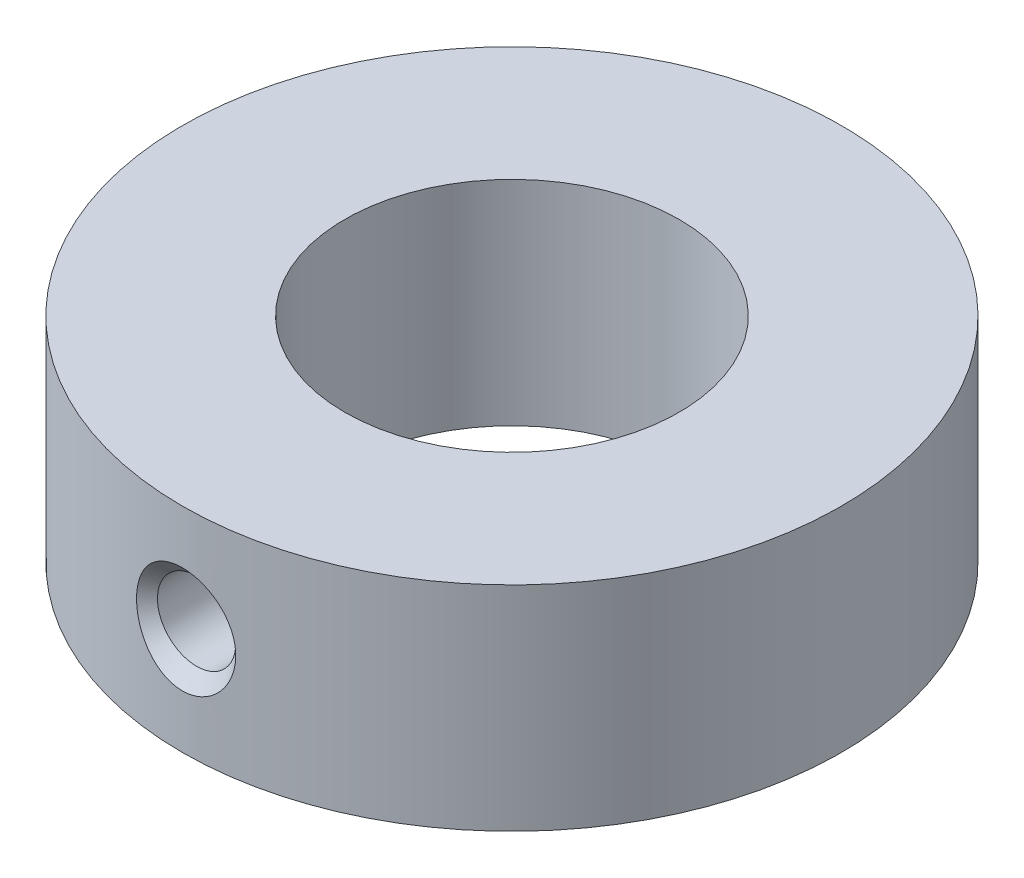
ISO-10303-21;
HEADER;
FILE_DESCRIPTION(('STEP AP214'),'2;1');
FILE_NAME('part.step','',(''),(''),'','','');
FILE_SCHEMA(('AUTOMOTIVE_DESIGN { 1 0 10303 214 1 1 1 1 }'));
ENDSEC;
DATA;
#1=APPLICATION_CONTEXT('core data for automotive mechanical design processes');
#2=APPLICATION_PROTOCOL_DEFINITION('international standard','automotive_design',2000,#1);
#3=PRODUCT_CONTEXT('',#1,'mechanical');
#4=PRODUCT('Part','Part','',(#3));
#5=PRODUCT_RELATED_PRODUCT_CATEGORY('part','',(#4));
#6=PRODUCT_DEFINITION_FORMATION('','',#4);
#7=PRODUCT_DEFINITION_CONTEXT('part definition',#1,'design');
#8=PRODUCT_DEFINITION('design','',#6,#7);
#9=PRODUCT_DEFINITION_SHAPE('','',#8);
#10=(LENGTH_UNIT() NAMED_UNIT(*) SI_UNIT(.MILLI.,.METRE.));
#11=(NAMED_UNIT(*) PLANE_ANGLE_UNIT() SI_UNIT($,.RADIAN.));
#12=(NAMED_UNIT(*) SI_UNIT($,.STERADIAN.) SOLID_ANGLE_UNIT());
#13=UNCERTAINTY_MEASURE_WITH_UNIT(LENGTH_MEASURE(1.E-05),#10,'distance_accuracy_value','');
#14=(GEOMETRIC_REPRESENTATION_CONTEXT(3) GLOBAL_UNCERTAINTY_ASSIGNED_CONTEXT((#13)) GLOBAL_UNIT_ASSIGNED_CONTEXT((#10,
#11,#12)) REPRESENTATION_CONTEXT('',''));
#15=CARTESIAN_POINT('',(0.,0.,0.));
#16=DIRECTION('',(0.,0.,1.));
#17=DIRECTION('',(1.,0.,0.));
#18=AXIS2_PLACEMENT_3D('',#15,#16,#17);
#19=CARTESIAN_POINT('',(0.,9.,0.));
#20=DIRECTION('',(0.,1.,0.));
#21=DIRECTION('',(0.,0.,1.));
#22=AXIS2_PLACEMENT_3D('',#19,#20,#21);
#23=PLANE('',#22);
#24=CARTESIAN_POINT('',(0.,9.,0.));
#25=DIRECTION('',(0.,1.,0.));
#26=DIRECTION('',(0.,0.,1.));
#27=AXIS2_PLACEMENT_3D('',#24,#25,#26);
#28=CIRCLE('',#27,13.9);
#29=CARTESIAN_POINT('',(0.,9.,13.9));
#30=VERTEX_POINT('',#29);
#31=EDGE_CURVE('E43',#30,#30,#28,.T.);
#32=ORIENTED_EDGE('',*,*,#31,.T.);
#33=EDGE_LOOP('',(#32));
#34=FACE_BOUND('',#33,.T.);
#35=CARTESIAN_POINT('',(0.,9.,0.));
#36=DIRECTION('',(0.,1.,0.));
#37=DIRECTION('',(0.,0.,1.));
#38=AXIS2_PLACEMENT_3D('',#35,#36,#37);
#39=CIRCLE('',#38,7.05);
#40=CARTESIAN_POINT('',(0.,9.,7.05));
#41=VERTEX_POINT('',#40);
#42=EDGE_CURVE('E52',#41,#41,#39,.T.);
#43=ORIENTED_EDGE('',*,*,#42,.F.);
#44=EDGE_LOOP('',(#43));
#45=FACE_BOUND('',#44,.T.);
#46=ADVANCED_FACE('F32',(#34,#45),#23,.T.);
#47=CARTESIAN_POINT('',(0.,0.,0.));
#48=DIRECTION('',(0.,1.,0.));
#49=DIRECTION('',(0.,0.,1.));
#50=AXIS2_PLACEMENT_3D('',#47,#48,#49);
#51=PLANE('',#50);
#52=CARTESIAN_POINT('',(0.,0.,0.));
#53=DIRECTION('',(0.,1.,0.));
#54=DIRECTION('',(0.,0.,1.));
#55=AXIS2_PLACEMENT_3D('',#52,#53,#54);
#56=CIRCLE('',#55,13.9);
#57=CARTESIAN_POINT('',(0.,0.,13.9));
#58=VERTEX_POINT('',#57);
#59=EDGE_CURVE('E47',#58,#58,#56,.T.);
#60=ORIENTED_EDGE('',*,*,#59,.F.);
#61=EDGE_LOOP('',(#60));
#62=FACE_BOUND('',#61,.T.);
#63=CARTESIAN_POINT('',(0.,0.,0.));
#64=DIRECTION('',(0.,1.,0.));
#65=DIRECTION('',(0.,0.,1.));
#66=AXIS2_PLACEMENT_3D('',#63,#64,#65);
#67=CIRCLE('',#66,7.05);
#68=CARTESIAN_POINT('',(0.,0.,7.05));
#69=VERTEX_POINT('',#68);
#70=EDGE_CURVE('E54',#69,#69,#67,.T.);
#71=ORIENTED_EDGE('',*,*,#70,.T.);
#72=EDGE_LOOP('',(#71));
#73=FACE_BOUND('',#72,.T.);
#74=ADVANCED_FACE('F85',(#62,#73),#51,.F.);
#75=CARTESIAN_POINT('',(0.,9.,0.));
#76=DIRECTION('',(0.,-1.,0.));
#77=DIRECTION('',(0.,0.,-1.));
#78=AXIS2_PLACEMENT_3D('',#75,#76,#77);
#79=CYLINDRICAL_SURFACE('',#78,13.9);
#80=CARTESIAN_POINT('',(-1.53089879882242,2.96850597907829,13.8154388267226));
#81=CARTESIAN_POINT('',(-1.60076330284176,3.04929211469892,13.8076973974552));
#82=CARTESIAN_POINT('',(-1.66476484408655,3.13518755119833,13.8000698974075));
#83=CARTESIAN_POINT('',(-1.78010285199223,3.31521868997544,13.7856671159582));
#84=CARTESIAN_POINT('',(-1.83142786842461,3.40936173880324,13.7788926077194));
#85=CARTESIAN_POINT('',(-1.92917776825246,3.62244290035624,13.7655791786175));
#86=CARTESIAN_POINT('',(-1.97281172094209,3.74269032332706,13.7593303935033));
#87=CARTESIAN_POINT('',(-2.04027592501968,3.98873344131143,13.7494886934367));
#88=CARTESIAN_POINT('',(-2.06409807725508,4.11453138329386,13.745896864726));
#89=CARTESIAN_POINT('',(-2.09202156957342,4.37316046333684,13.7416761556676));
#90=CARTESIAN_POINT('',(-2.09534656476857,4.50607806985111,13.7411639350301));
#91=CARTESIAN_POINT('',(-2.08013349447878,4.77063044424011,13.7434747980332));
#92=CARTESIAN_POINT('',(-2.06159402952724,4.90226512945582,13.7462980951685));
#93=CARTESIAN_POINT('',(-2.00270450893207,5.16187636929043,13.7550014631186));
#94=CARTESIAN_POINT('',(-1.96213607221481,5.28980255306261,13.7609121172883));
#95=CARTESIAN_POINT('',(-1.85983499102708,5.53678555926389,13.7751104204657));
#96=CARTESIAN_POINT('',(-1.79810177869774,5.65584214361396,13.7833981332497));
#97=CARTESIAN_POINT('',(-1.65611699859829,5.87909361138458,13.8011695659512));
#98=CARTESIAN_POINT('',(-1.57623961948876,5.98352791455788,13.8106275659425));
#99=CARTESIAN_POINT('',(-1.39911632461371,6.17647676671145,13.8296918430309));
#100=CARTESIAN_POINT('',(-1.30187575994685,6.26499620361792,13.8392980736143));
#101=CARTESIAN_POINT('',(-1.09834362647047,6.41813988889753,13.8568926829638));
#102=CARTESIAN_POINT('',(-0.992848834330881,6.48381404676061,13.8649411209322));
#103=CARTESIAN_POINT('',(-0.771544118522445,6.59486639169449,13.8790116900012));
#104=CARTESIAN_POINT('',(-0.6557404875511,6.64025685978678,13.8850350466649));
#105=CARTESIAN_POINT('',(-0.426803331293696,6.70587695410003,13.893881111543));
#106=CARTESIAN_POINT('',(-0.314157321274528,6.72778261668313,13.8969155293286));
#107=CARTESIAN_POINT('',(-0.0867397000029351,6.75142189097696,13.9001937015719));
#108=CARTESIAN_POINT('',(0.0280311353990341,6.75316272556772,13.9004384552643));
#109=CARTESIAN_POINT('',(0.250194119290882,6.73683732113453,13.898169828179));
#110=CARTESIAN_POINT('',(0.357663617578708,6.71977872457961,13.8957967554707));
#111=CARTESIAN_POINT('',(0.56822610479701,6.66817758430457,13.8887804092816));
#112=CARTESIAN_POINT('',(0.671319053279515,6.63363487903484,13.8841371148244));
#113=CARTESIAN_POINT('',(0.87149172683197,6.54798921949207,13.8730193716059));
#114=CARTESIAN_POINT('',(0.968499480407843,6.49672111873809,13.8665267472408));
#115=CARTESIAN_POINT('',(1.15313025734481,6.37956149993203,13.8523961623245));
#116=CARTESIAN_POINT('',(1.24075107320491,6.31366655326723,13.8447579333739));
#117=CARTESIAN_POINT('',(1.40983175460091,6.16493451105966,13.8285945325793));
#118=CARTESIAN_POINT('',(1.49059971772676,6.08131443731861,13.8200436551361));
#119=CARTESIAN_POINT('',(1.63809050491333,5.90246495999842,13.8033395102507));
#120=CARTESIAN_POINT('',(1.70480880876082,5.80723183565268,13.7951863714196));
#121=CARTESIAN_POINT('',(1.82738500588707,5.60039497859991,13.7795054266236));
#122=CARTESIAN_POINT('',(1.88209550128074,5.48810380323639,13.7720666339654));
#123=CARTESIAN_POINT('',(1.97306110776339,5.25616679298892,13.7593293990748));
#124=CARTESIAN_POINT('',(2.00931141548492,5.13651905298341,13.7540315139836));
#125=CARTESIAN_POINT('',(2.06410725683522,4.88665384025432,13.7459187346766));
#126=CARTESIAN_POINT('',(2.08164338543405,4.75620948235818,13.7432459726704));
#127=CARTESIAN_POINT('',(2.09527853545902,4.49417231188391,13.7411736733822));
#128=CARTESIAN_POINT('',(2.09137435688635,4.36257933079844,13.7417746247069));
#129=CARTESIAN_POINT('',(2.06190628462766,4.0992495483567,13.7462274861183));
#130=CARTESIAN_POINT('',(2.03591657601295,3.96756113231756,13.7501433019678));
#131=CARTESIAN_POINT('',(1.96220882622502,3.71051045875258,13.7608543767407));
#132=CARTESIAN_POINT('',(1.91448944671496,3.5851485914091,13.7676498130192));
#133=CARTESIAN_POINT('',(1.79877829387997,3.34561828117921,13.7832420632689));
#134=CARTESIAN_POINT('',(1.73096667422518,3.23136187071041,13.792020933635));
#135=CARTESIAN_POINT('',(1.57633505106809,3.01657600537709,13.8105469778927));
#136=CARTESIAN_POINT('',(1.48951823697956,2.91604425185873,13.8202939891632));
#137=CARTESIAN_POINT('',(1.3030223272759,2.73641771282379,13.8390938491719));
#138=CARTESIAN_POINT('',(1.20405190569675,2.65659013108516,13.8481585590675));
#139=CARTESIAN_POINT('',(0.993140111365647,2.51623972810326,13.8648771335431));
#140=CARTESIAN_POINT('',(0.881205991531545,2.45570618270503,13.8725317808723));
#141=CARTESIAN_POINT('',(0.656478433090254,2.36046717471768,13.8849105061405));
#142=CARTESIAN_POINT('',(0.544366084223176,2.32417752351587,13.8898099973427));
#143=CARTESIAN_POINT('',(0.31538374864193,2.27226383976453,13.8968924025971));
#144=CARTESIAN_POINT('',(0.198516200314679,2.25662934988956,13.8990766912729));
#145=CARTESIAN_POINT('',(-0.028388688382504,2.24710117681956,13.9004037616399));
#146=CARTESIAN_POINT('',(-0.138369936619351,2.25184573377773,13.8997370643035));
#147=CARTESIAN_POINT('',(-0.355913187305251,2.27980413933094,13.8958684191886));
#148=CARTESIAN_POINT('',(-0.463475148922865,2.30301829940602,13.8926664286537));
#149=CARTESIAN_POINT('',(-0.671983071924666,2.36656681533507,13.8841356831634));
#150=CARTESIAN_POINT('',(-0.772989124473424,2.40670866751108,13.8788308811175));
#151=CARTESIAN_POINT('',(-0.967167359408599,2.50254823523497,13.8666526326977));
#152=CARTESIAN_POINT('',(-1.06034232159274,2.55824040029674,13.8597797461913));
#153=CARTESIAN_POINT('',(-1.21909294061062,2.67068771641337,13.8466181356659));
#154=CARTESIAN_POINT('',(-1.28645072652676,2.72497688280465,13.8404898806667));
#155=CARTESIAN_POINT('',(-1.41411460272698,2.84123429584318,13.8280291780848));
#156=CARTESIAN_POINT('',(-1.47442232006944,2.90320076384838,13.8216967780481));
#157=CARTESIAN_POINT('',(-1.53089879882242,2.96850597907829,13.8154388267226));
#158=B_SPLINE_CURVE_WITH_KNOTS('',3,(#80,#81,#82,#83,#84,#85,#86,#87,#88,#89,#90,#91,#92,#93,
#94,#95,#96,#97,#98,#99,#100,#101,#102,#103,#104,#105,#106,#107,#108,#109,#110,#111,#112,#113,
#114,#115,#116,#117,#118,#119,#120,#121,#122,#123,#124,#125,#126,#127,#128,#129,#130,#131,#132,
#133,#134,#135,#136,#137,#138,#139,#140,#141,#142,#143,#144,#145,#146,#147,#148,#149,#150,#151,
#152,#153,#154,#155,#156,#157),.UNSPECIFIED.,.T.,.F.,(4,2,2,2,2,2,2,2,2,2,2,2,2,2,2,2,2,2,2,2,2,
2,2,2,2,2,2,2,2,2,2,2,2,2,2,2,2,2,4),(0.,0.321025933779569,0.64234078638139,1.02479852345279,
1.40741253420817,1.80443352519475,2.20147992946685,2.60253623048607,3.00360329283831,
3.39704903880459,3.79037373874577,4.16196971699887,4.53334040182676,4.87595653839754,
5.21844994881303,5.5434411312647,5.86843531662356,6.19674087141988,6.52512346425478,
6.87334284147632,7.22167408113283,7.59541736963666,7.96925785705697,8.36237666049724,
8.75555413911772,9.15648879988137,9.55744815766952,9.95491590172298,10.3523169945982,
10.7327262846136,11.1129237624799,11.4648875430455,11.8166730624971,12.1453306375983,
12.473993755452,12.7990159943712,13.1239223687206,13.3834906301261,13.6429988680038),.UNSPECIFIED.);
#159=CARTESIAN_POINT('',(-1.53089879882242,2.96850597907829,13.8154388267226));
#160=VERTEX_POINT('',#159);
#161=EDGE_CURVE('E10',#160,#160,#158,.T.);
#162=ORIENTED_EDGE('',*,*,#161,.T.);
#163=EDGE_LOOP('',(#162));
#164=FACE_BOUND('',#163,.T.);
#165=ORIENTED_EDGE('',*,*,#31,.F.);
#166=EDGE_LOOP('',(#165));
#167=FACE_BOUND('',#166,.T.);
#168=ORIENTED_EDGE('',*,*,#59,.T.);
#169=EDGE_LOOP('',(#168));
#170=FACE_BOUND('',#169,.T.);
#171=ADVANCED_FACE('F34',(#164,#167,#170),#79,.T.);
#172=CARTESIAN_POINT('',(0.,9.,0.));
#173=DIRECTION('',(0.,-1.,0.));
#174=DIRECTION('',(0.,0.,-1.));
#175=AXIS2_PLACEMENT_3D('',#172,#173,#174);
#176=CYLINDRICAL_SURFACE('',#175,7.05);
#177=CARTESIAN_POINT('',(1.65,4.5,6.85419579527752));
#178=CARTESIAN_POINT('',(1.64999710020304,4.40869116116013,6.85419761836683));
#179=CARTESIAN_POINT('',(1.64239483208734,4.31734883235972,6.85604026387858));
#180=CARTESIAN_POINT('',(1.61222704541117,4.13727382421544,6.86319573610244));
#181=CARTESIAN_POINT('',(1.58965171565924,4.04854289584861,6.86851083812901));
#182=CARTESIAN_POINT('',(1.5302975299503,3.8763214301128,6.8819770340033));
#183=CARTESIAN_POINT('',(1.49353555553602,3.79282480089412,6.89012475600812));
#184=CARTESIAN_POINT('',(1.40690149973241,3.6331787288149,6.90833403073641));
#185=CARTESIAN_POINT('',(1.35702929129515,3.55702935716453,6.91839560200623));
#186=CARTESIAN_POINT('',(1.24456282092129,3.41276845042453,6.93951618701149));
#187=CARTESIAN_POINT('',(1.18176253119231,3.34481959853667,6.95058949605957));
#188=CARTESIAN_POINT('',(1.04566688534741,3.22031732636267,6.97236127579363));
#189=CARTESIAN_POINT('',(0.972370638674519,3.16376487401506,6.98305971457679));
#190=CARTESIAN_POINT('',(0.816261582389971,3.06300668603114,7.0030332151722));
#191=CARTESIAN_POINT('',(0.733344130921931,3.01895902023367,7.01228943934605));
#192=CARTESIAN_POINT('',(0.561030191688625,2.94548582234554,7.02817334211907));
#193=CARTESIAN_POINT('',(0.471634540375595,2.91605840635831,7.0348013593544));
#194=CARTESIAN_POINT('',(0.290595611354746,2.87317719777315,7.04458101228306));
#195=CARTESIAN_POINT('',(0.199020953093845,2.85944760874982,7.04779259899193));
#196=CARTESIAN_POINT('',(0.0148155918313051,2.84748787128561,7.050585816036));
#197=CARTESIAN_POINT('',(-0.0778149720368732,2.84925570384414,7.05016791921956));
#198=CARTESIAN_POINT('',(-0.259595993808581,2.86803855602367,7.04579450940627));
#199=CARTESIAN_POINT('',(-0.348779095449232,2.88475610952222,7.04190801672207));
#200=CARTESIAN_POINT('',(-0.5230375181746,2.93248788469393,7.0311135420495));
#201=CARTESIAN_POINT('',(-0.608112636639272,2.96350281076919,7.02420541119209));
#202=CARTESIAN_POINT('',(-0.772545882384748,3.03920130577938,7.00803541549085));
#203=CARTESIAN_POINT('',(-0.851851696686785,3.08399434115942,6.99875480493153));
#204=CARTESIAN_POINT('',(-1.00192750946546,3.18589528457425,6.97885238153381));
#205=CARTESIAN_POINT('',(-1.07269618739228,3.24300509400546,6.968230361721));
#206=CARTESIAN_POINT('',(-1.20546068843072,3.36952640687791,6.94651017117225));
#207=CARTESIAN_POINT('',(-1.26720790469563,3.43919812557645,6.93540668412343));
#208=CARTESIAN_POINT('',(-1.37819294280703,3.58802354018615,6.91420899140739));
#209=CARTESIAN_POINT('',(-1.4274303182929,3.66717757428529,6.90411482176117));
#210=CARTESIAN_POINT('',(-1.51213115111205,3.83316297208708,6.88606206122414));
#211=CARTESIAN_POINT('',(-1.54754157639143,3.92002235674401,6.8781117281928));
#212=CARTESIAN_POINT('',(-1.60318462179719,4.09869051635579,6.865356700298));
#213=CARTESIAN_POINT('',(-1.62342004106163,4.19049837517881,6.86055142532699));
#214=CARTESIAN_POINT('',(-1.64774042060665,4.37416963157106,6.85475058560726));
#215=CARTESIAN_POINT('',(-1.65219001737318,4.46598208813264,6.85366902453307));
#216=CARTESIAN_POINT('',(-1.64580491645887,4.64903711295998,6.85520508865633));
#217=CARTESIAN_POINT('',(-1.63497143517329,4.7402797259996,6.85782241945534));
#218=CARTESIAN_POINT('',(-1.59864571380856,4.91829577219152,6.86637957529232));
#219=CARTESIAN_POINT('',(-1.57335969683842,5.0051137461173,6.87227262725991));
#220=CARTESIAN_POINT('',(-1.5090724874086,5.17328000386652,6.88667398352315));
#221=CARTESIAN_POINT('',(-1.47006982990359,5.25462770231543,6.89518256716597));
#222=CARTESIAN_POINT('',(-1.37867228540587,5.41110661656585,6.91404147794497));
#223=CARTESIAN_POINT('',(-1.32605590807335,5.48610483070707,6.924421310546));
#224=CARTESIAN_POINT('',(-1.20920965251348,5.62634127225989,6.94577798641202));
#225=CARTESIAN_POINT('',(-1.14497811195574,5.6915781002032,6.95675491497432));
#226=CARTESIAN_POINT('',(-1.00506355754094,5.81188442811851,6.97835623241658));
#227=CARTESIAN_POINT('',(-0.929162958487524,5.86670357564704,6.98896786585951));
#228=CARTESIAN_POINT('',(-0.769019794466527,5.96281499431145,7.00839529084308));
#229=CARTESIAN_POINT('',(-0.684777645537125,6.00410793963006,7.01721117188062));
#230=CARTESIAN_POINT('',(-0.510900757226423,6.07166084181913,7.03200067871923));
#231=CARTESIAN_POINT('',(-0.421307460809338,6.09802305282232,7.03799358899231));
#232=CARTESIAN_POINT('',(-0.238805789769578,6.13528028857747,7.04654582485114));
#233=CARTESIAN_POINT('',(-0.145897973861214,6.14617790761837,7.04910572634314));
#234=CARTESIAN_POINT('',(0.0382308609188984,6.15206596009069,7.05048336419427));
#235=CARTESIAN_POINT('',(0.129439533786052,6.14742805138254,7.04938853518127));
#236=CARTESIAN_POINT('',(0.309739077894008,6.12321747313719,7.04377016495729));
#237=CARTESIAN_POINT('',(0.398829998401514,6.10364515138062,7.03924670358958));
#238=CARTESIAN_POINT('',(0.572029135649094,6.05030993227369,7.02728921016593));
#239=CARTESIAN_POINT('',(0.656156621963105,6.01660668843901,7.01986742229068));
#240=CARTESIAN_POINT('',(0.817608433718495,5.93602206594159,7.0029003702831));
#241=CARTESIAN_POINT('',(0.894931998998965,5.88913921724969,6.99335486930046));
#242=CARTESIAN_POINT('',(1.04237055588517,5.78235147532118,6.97292099717567));
#243=CARTESIAN_POINT('',(1.11229596485024,5.72218947709439,6.96200826823773));
#244=CARTESIAN_POINT('',(1.2411851834225,5.59106072238356,6.94019035247552));
#245=CARTESIAN_POINT('',(1.30014628946125,5.52009130884226,6.92928516817028));
#246=CARTESIAN_POINT('',(1.40633984406993,5.36801221926477,6.90852295962363));
#247=CARTESIAN_POINT('',(1.45337218876597,5.28676000203183,6.89868522606308));
#248=CARTESIAN_POINT('',(1.53303895649666,5.11728718020584,6.88142175845062));
#249=CARTESIAN_POINT('',(1.56568476874859,5.02907215325458,6.87399411766182));
#250=CARTESIAN_POINT('',(1.61027697011916,4.86739723473994,6.86366580374711));
#251=CARTESIAN_POINT('',(1.6251427440994,4.79476852154489,6.86013957478938));
#252=CARTESIAN_POINT('',(1.64500511791024,4.64810048921177,6.85540390564564));
#253=CARTESIAN_POINT('',(1.65000235204633,4.57406126104416,6.85419431655656));
#254=CARTESIAN_POINT('',(1.65,4.5,6.85419579527752));
#255=B_SPLINE_CURVE_WITH_KNOTS('',3,(#177,#178,#179,#180,#181,#182,#183,#184,#185,#186,#187,
#188,#189,#190,#191,#192,#193,#194,#195,#196,#197,#198,#199,#200,#201,#202,#203,#204,#205,#206,
#207,#208,#209,#210,#211,#212,#213,#214,#215,#216,#217,#218,#219,#220,#221,#222,#223,#224,#225,
#226,#227,#228,#229,#230,#231,#232,#233,#234,#235,#236,#237,#238,#239,#240,#241,#242,#243,#244,
#245,#246,#247,#248,#249,#250,#251,#252,#253,#254),.UNSPECIFIED.,.T.,.F.,(4,2,2,2,2,2,2,2,2,2,2,
2,2,2,2,2,2,2,2,2,2,2,2,2,2,2,2,2,2,2,2,2,2,2,2,2,2,2,4),(0.,0.273654838505698,
0.547489168428393,0.820998646204724,1.09451077458912,1.3727761236434,1.65106509685523,
1.93272937477138,2.21435734933528,2.49095744390451,2.76752150361108,3.03870206659411,
3.3098959915131,3.58330276546001,3.85675177670431,4.13670271818311,4.416663647122,
4.69768803533874,4.97866057384453,5.25309908162558,5.52751574780724,5.79811117622258,
6.06873551514447,6.34407487914042,6.61945368018504,6.90078705137316,7.18210639800625,
7.4614750613033,7.74079685309248,8.01348458642649,8.28616596982098,8.55770764126495,
8.82927961199822,9.10666084899613,9.38411039199095,9.66594510818718,9.94755630502202,
10.1695339963429,10.391497419469),.UNSPECIFIED.);
#256=CARTESIAN_POINT('',(1.65,4.5,6.85419579527752));
#257=VERTEX_POINT('',#256);
#258=EDGE_CURVE('E57',#257,#257,#255,.T.);
#259=ORIENTED_EDGE('',*,*,#258,.F.);
#260=EDGE_LOOP('',(#259));
#261=FACE_BOUND('',#260,.T.);
#262=ORIENTED_EDGE('',*,*,#42,.T.);
#263=EDGE_LOOP('',(#262));
#264=FACE_BOUND('',#263,.T.);
#265=ORIENTED_EDGE('',*,*,#70,.F.);
#266=EDGE_LOOP('',(#265));
#267=FACE_BOUND('',#266,.T.);
#268=ADVANCED_FACE('F76',(#261,#264,#267),#176,.F.);
#269=CARTESIAN_POINT('',(0.,4.5,13.9));
#270=DIRECTION('',(0.,0.,1.));
#271=DIRECTION('',(1.,0.,0.));
#272=AXIS2_PLACEMENT_3D('',#269,#270,#271);
#273=CONICAL_SURFACE('',#272,2.25,0.785398163397448);
#274=CARTESIAN_POINT('',(0.,4.5,13.3));
#275=DIRECTION('',(0.,0.,1.));
#276=DIRECTION('',(1.,0.,0.));
#277=AXIS2_PLACEMENT_3D('',#274,#275,#276);
#278=CIRCLE('',#277,1.65);
#279=CARTESIAN_POINT('',(1.65,4.5,13.3));
#280=VERTEX_POINT('',#279);
#281=EDGE_CURVE('E66',#280,#280,#278,.T.);
#282=ORIENTED_EDGE('',*,*,#281,.F.);
#283=EDGE_LOOP('',(#282));
#284=FACE_BOUND('',#283,.T.);
#285=ORIENTED_EDGE('',*,*,#161,.F.);
#286=EDGE_LOOP('',(#285));
#287=FACE_BOUND('',#286,.T.);
#288=ADVANCED_FACE('F72',(#284,#287),#273,.F.);
#289=CARTESIAN_POINT('',(0.,4.5,13.9));
#290=DIRECTION('',(0.,0.,1.));
#291=DIRECTION('',(1.,0.,0.));
#292=AXIS2_PLACEMENT_3D('',#289,#290,#291);
#293=CYLINDRICAL_SURFACE('',#292,1.65);
#294=ORIENTED_EDGE('',*,*,#281,.T.);
#295=EDGE_LOOP('',(#294));
#296=FACE_BOUND('',#295,.T.);
#297=ORIENTED_EDGE('',*,*,#258,.T.);
#298=EDGE_LOOP('',(#297));
#299=FACE_BOUND('',#298,.T.);
#300=ADVANCED_FACE('F69',(#296,#299),#293,.F.);
#301=CLOSED_SHELL('',(#46,#74,#171,#268,#288,#300));
#302=MANIFOLD_SOLID_BREP('B2',#301);
#303=ADVANCED_BREP_SHAPE_REPRESENTATION('',(#18,#302),#14);
#304=SHAPE_DEFINITION_REPRESENTATION(#9,#303);
ENDSEC;
END-ISO-10303-21;
